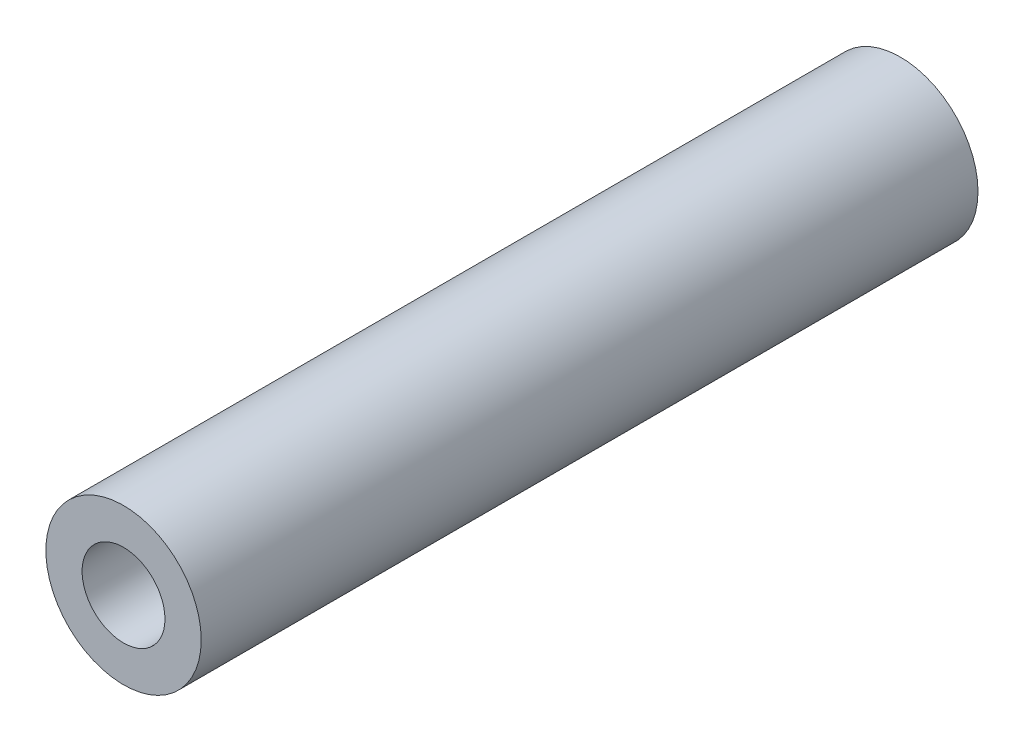
ISO-10303-21;
HEADER;
FILE_DESCRIPTION(('STEP AP214'),'2;1');
FILE_NAME('part.step','',(''),(''),'','','');
FILE_SCHEMA(('AUTOMOTIVE_DESIGN { 1 0 10303 214 1 1 1 1 }'));
ENDSEC;
DATA;
#1=APPLICATION_CONTEXT('core data for automotive mechanical design processes');
#2=APPLICATION_PROTOCOL_DEFINITION('international standard','automotive_design',2000,#1);
#3=PRODUCT_CONTEXT('',#1,'mechanical');
#4=PRODUCT('Part','Part','',(#3));
#5=PRODUCT_RELATED_PRODUCT_CATEGORY('part','',(#4));
#6=PRODUCT_DEFINITION_FORMATION('','',#4);
#7=PRODUCT_DEFINITION_CONTEXT('part definition',#1,'design');
#8=PRODUCT_DEFINITION('design','',#6,#7);
#9=PRODUCT_DEFINITION_SHAPE('','',#8);
#10=(LENGTH_UNIT() NAMED_UNIT(*) SI_UNIT(.MILLI.,.METRE.));
#11=(NAMED_UNIT(*) PLANE_ANGLE_UNIT() SI_UNIT($,.RADIAN.));
#12=(NAMED_UNIT(*) SI_UNIT($,.STERADIAN.) SOLID_ANGLE_UNIT());
#13=UNCERTAINTY_MEASURE_WITH_UNIT(LENGTH_MEASURE(1.E-05),#10,'distance_accuracy_value','');
#14=(GEOMETRIC_REPRESENTATION_CONTEXT(3) GLOBAL_UNCERTAINTY_ASSIGNED_CONTEXT((#13)) GLOBAL_UNIT_ASSIGNED_CONTEXT((#10,
#11,#12)) REPRESENTATION_CONTEXT('',''));
#15=CARTESIAN_POINT('',(0.,0.,0.));
#16=DIRECTION('',(0.,0.,1.));
#17=DIRECTION('',(1.,0.,0.));
#18=AXIS2_PLACEMENT_3D('',#15,#16,#17);
#19=CARTESIAN_POINT('',(0.,0.,15.));
#20=DIRECTION('',(0.,0.,1.));
#21=DIRECTION('',(1.,0.,0.));
#22=AXIS2_PLACEMENT_3D('',#19,#20,#21);
#23=PLANE('',#22);
#24=CARTESIAN_POINT('',(0.,0.,15.));
#25=DIRECTION('',(0.,0.,1.));
#26=DIRECTION('',(1.,0.,0.));
#27=AXIS2_PLACEMENT_3D('',#24,#25,#26);
#28=CIRCLE('',#27,3.);
#29=CARTESIAN_POINT('',(3.,0.,15.));
#30=VERTEX_POINT('',#29);
#31=EDGE_CURVE('E10',#30,#30,#28,.T.);
#32=ORIENTED_EDGE('',*,*,#31,.T.);
#33=EDGE_LOOP('',(#32));
#34=FACE_BOUND('',#33,.T.);
#35=CARTESIAN_POINT('',(0.,0.,15.));
#36=DIRECTION('',(0.,0.,1.));
#37=DIRECTION('',(1.,0.,0.));
#38=AXIS2_PLACEMENT_3D('',#35,#36,#37);
#39=CIRCLE('',#38,1.6);
#40=CARTESIAN_POINT('',(1.6,0.,15.));
#41=VERTEX_POINT('',#40);
#42=EDGE_CURVE('E38',#41,#41,#39,.T.);
#43=ORIENTED_EDGE('',*,*,#42,.F.);
#44=EDGE_LOOP('',(#43));
#45=FACE_BOUND('',#44,.T.);
#46=ADVANCED_FACE('F31',(#34,#45),#23,.T.);
#47=CARTESIAN_POINT('',(0.,0.,15.));
#48=DIRECTION('',(0.,0.,-1.));
#49=DIRECTION('',(-1.,0.,0.));
#50=AXIS2_PLACEMENT_3D('',#47,#48,#49);
#51=CYLINDRICAL_SURFACE('',#50,3.);
#52=ORIENTED_EDGE('',*,*,#31,.F.);
#53=EDGE_LOOP('',(#52));
#54=FACE_BOUND('',#53,.T.);
#55=CARTESIAN_POINT('',(0.,0.,-15.));
#56=DIRECTION('',(0.,0.,1.));
#57=DIRECTION('',(1.,0.,0.));
#58=AXIS2_PLACEMENT_3D('',#55,#56,#57);
#59=CIRCLE('',#58,3.);
#60=CARTESIAN_POINT('',(3.,0.,-15.));
#61=VERTEX_POINT('',#60);
#62=EDGE_CURVE('E42',#61,#61,#59,.T.);
#63=ORIENTED_EDGE('',*,*,#62,.T.);
#64=EDGE_LOOP('',(#63));
#65=FACE_BOUND('',#64,.T.);
#66=ADVANCED_FACE('F33',(#54,#65),#51,.T.);
#67=CARTESIAN_POINT('',(0.,0.,15.));
#68=DIRECTION('',(0.,0.,-1.));
#69=DIRECTION('',(-1.,0.,0.));
#70=AXIS2_PLACEMENT_3D('',#67,#68,#69);
#71=CYLINDRICAL_SURFACE('',#70,1.6);
#72=ORIENTED_EDGE('',*,*,#42,.T.);
#73=EDGE_LOOP('',(#72));
#74=FACE_BOUND('',#73,.T.);
#75=CARTESIAN_POINT('',(0.,0.,-15.));
#76=DIRECTION('',(0.,0.,1.));
#77=DIRECTION('',(1.,0.,0.));
#78=AXIS2_PLACEMENT_3D('',#75,#76,#77);
#79=CIRCLE('',#78,1.6);
#80=CARTESIAN_POINT('',(1.6,0.,-15.));
#81=VERTEX_POINT('',#80);
#82=EDGE_CURVE('E46',#81,#81,#79,.T.);
#83=ORIENTED_EDGE('',*,*,#82,.F.);
#84=EDGE_LOOP('',(#83));
#85=FACE_BOUND('',#84,.T.);
#86=ADVANCED_FACE('F55',(#74,#85),#71,.F.);
#87=CARTESIAN_POINT('',(0.,0.,-15.));
#88=DIRECTION('',(0.,0.,1.));
#89=DIRECTION('',(1.,0.,0.));
#90=AXIS2_PLACEMENT_3D('',#87,#88,#89);
#91=PLANE('',#90);
#92=ORIENTED_EDGE('',*,*,#82,.T.);
#93=EDGE_LOOP('',(#92));
#94=FACE_BOUND('',#93,.T.);
#95=ORIENTED_EDGE('',*,*,#62,.F.);
#96=EDGE_LOOP('',(#95));
#97=FACE_BOUND('',#96,.T.);
#98=ADVANCED_FACE('F52',(#94,#97),#91,.F.);
#99=CLOSED_SHELL('',(#46,#66,#86,#98));
#100=MANIFOLD_SOLID_BREP('B2',#99);
#101=ADVANCED_BREP_SHAPE_REPRESENTATION('',(#18,#100),#14);
#102=SHAPE_DEFINITION_REPRESENTATION(#9,#101);
ENDSEC;
END-ISO-10303-21;
